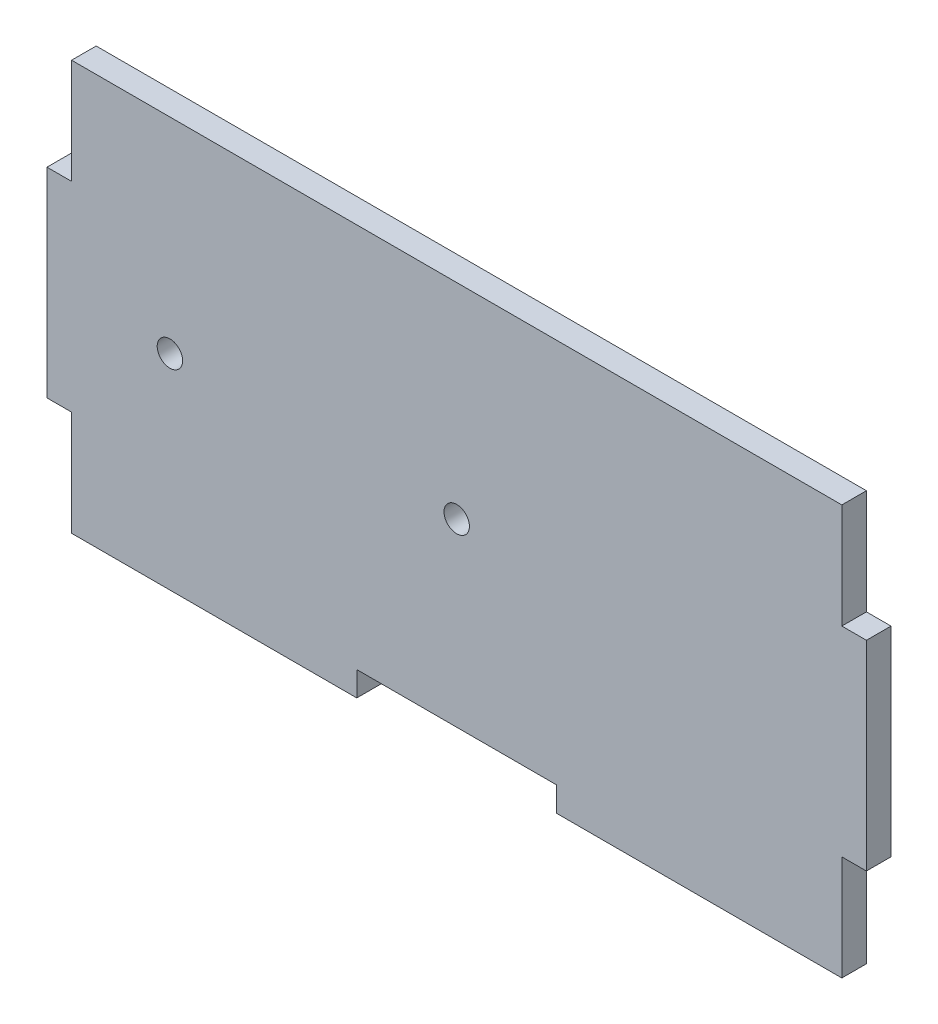
ISO-10303-21;
HEADER;
FILE_DESCRIPTION(('STEP AP214'),'2;1');
FILE_NAME('part.step','',(''),(''),'','','');
FILE_SCHEMA(('AUTOMOTIVE_DESIGN { 1 0 10303 214 1 1 1 1 }'));
ENDSEC;
DATA;
#1=APPLICATION_CONTEXT('core data for automotive mechanical design processes');
#2=APPLICATION_PROTOCOL_DEFINITION('international standard','automotive_design',2000,#1);
#3=PRODUCT_CONTEXT('',#1,'mechanical');
#4=PRODUCT('Part','Part','',(#3));
#5=PRODUCT_RELATED_PRODUCT_CATEGORY('part','',(#4));
#6=PRODUCT_DEFINITION_FORMATION('','',#4);
#7=PRODUCT_DEFINITION_CONTEXT('part definition',#1,'design');
#8=PRODUCT_DEFINITION('design','',#6,#7);
#9=PRODUCT_DEFINITION_SHAPE('','',#8);
#10=(LENGTH_UNIT() NAMED_UNIT(*) SI_UNIT(.MILLI.,.METRE.));
#11=(NAMED_UNIT(*) PLANE_ANGLE_UNIT() SI_UNIT($,.RADIAN.));
#12=(NAMED_UNIT(*) SI_UNIT($,.STERADIAN.) SOLID_ANGLE_UNIT());
#13=UNCERTAINTY_MEASURE_WITH_UNIT(LENGTH_MEASURE(1.E-05),#10,'distance_accuracy_value','');
#14=(GEOMETRIC_REPRESENTATION_CONTEXT(3) GLOBAL_UNCERTAINTY_ASSIGNED_CONTEXT((#13)) GLOBAL_UNIT_ASSIGNED_CONTEXT((#10,
#11,#12)) REPRESENTATION_CONTEXT('',''));
#15=CARTESIAN_POINT('',(0.,0.,0.));
#16=DIRECTION('',(0.,0.,1.));
#17=DIRECTION('',(1.,0.,0.));
#18=AXIS2_PLACEMENT_3D('',#15,#16,#17);
#19=CARTESIAN_POINT('',(280.,103.,3.));
#20=DIRECTION('',(0.,-1.,0.));
#21=DIRECTION('',(0.,0.,-1.));
#22=AXIS2_PLACEMENT_3D('',#19,#20,#21);
#23=PLANE('',#22);
#24=DIRECTION('',(-1.,0.,0.));
#25=VECTOR('',#24,1.);
#26=CARTESIAN_POINT('',(280.,103.,0.));
#27=LINE('',#26,#25);
#28=CARTESIAN_POINT('',(280.,103.,0.));
#29=VERTEX_POINT('',#28);
#30=CARTESIAN_POINT('',(186.,103.,0.));
#31=VERTEX_POINT('',#30);
#32=EDGE_CURVE('E176',#29,#31,#27,.T.);
#33=ORIENTED_EDGE('',*,*,#32,.T.);
#34=DIRECTION('',(0.,0.,-1.));
#35=VECTOR('',#34,1.);
#36=CARTESIAN_POINT('',(186.,103.,3.));
#37=LINE('',#36,#35);
#38=CARTESIAN_POINT('',(186.,103.,3.));
#39=VERTEX_POINT('',#38);
#40=EDGE_CURVE('E11',#39,#31,#37,.T.);
#41=ORIENTED_EDGE('',*,*,#40,.F.);
#42=DIRECTION('',(-1.,0.,0.));
#43=VECTOR('',#42,1.);
#44=CARTESIAN_POINT('',(280.,103.,3.));
#45=LINE('',#44,#43);
#46=CARTESIAN_POINT('',(280.,103.,3.));
#47=VERTEX_POINT('',#46);
#48=EDGE_CURVE('E208',#47,#39,#45,.T.);
#49=ORIENTED_EDGE('',*,*,#48,.F.);
#50=DIRECTION('',(0.,0.,-1.));
#51=VECTOR('',#50,1.);
#52=CARTESIAN_POINT('',(280.,103.,3.));
#53=LINE('',#52,#51);
#54=EDGE_CURVE('E172',#47,#29,#53,.T.);
#55=ORIENTED_EDGE('',*,*,#54,.T.);
#56=EDGE_LOOP('',(#33,#41,#49,#55));
#57=FACE_BOUND('',#56,.T.);
#58=ADVANCED_FACE('F32',(#57),#23,.F.);
#59=CARTESIAN_POINT('',(186.,103.,3.));
#60=DIRECTION('',(1.,0.,0.));
#61=DIRECTION('',(0.,0.,-1.));
#62=AXIS2_PLACEMENT_3D('',#59,#60,#61);
#63=PLANE('',#62);
#64=DIRECTION('',(0.,-1.,0.));
#65=VECTOR('',#64,1.);
#66=CARTESIAN_POINT('',(186.,103.,0.));
#67=LINE('',#66,#65);
#68=CARTESIAN_POINT('',(186.,90.195,0.));
#69=VERTEX_POINT('',#68);
#70=EDGE_CURVE('E179',#31,#69,#67,.T.);
#71=ORIENTED_EDGE('',*,*,#70,.T.);
#72=DIRECTION('',(0.,0.,-1.));
#73=VECTOR('',#72,1.);
#74=CARTESIAN_POINT('',(186.,90.195,3.));
#75=LINE('',#74,#73);
#76=CARTESIAN_POINT('',(186.,90.195,3.));
#77=VERTEX_POINT('',#76);
#78=EDGE_CURVE('E40',#77,#69,#75,.T.);
#79=ORIENTED_EDGE('',*,*,#78,.F.);
#80=DIRECTION('',(0.,-1.,0.));
#81=VECTOR('',#80,1.);
#82=CARTESIAN_POINT('',(186.,103.,3.));
#83=LINE('',#82,#81);
#84=EDGE_CURVE('E115',#39,#77,#83,.T.);
#85=ORIENTED_EDGE('',*,*,#84,.F.);
#86=ORIENTED_EDGE('',*,*,#40,.T.);
#87=EDGE_LOOP('',(#71,#79,#85,#86));
#88=FACE_BOUND('',#87,.T.);
#89=ADVANCED_FACE('F307',(#88),#63,.F.);
#90=CARTESIAN_POINT('',(186.,90.195,3.));
#91=DIRECTION('',(0.,-1.,0.));
#92=DIRECTION('',(0.,0.,-1.));
#93=AXIS2_PLACEMENT_3D('',#90,#91,#92);
#94=PLANE('',#93);
#95=DIRECTION('',(-1.,0.,0.));
#96=VECTOR('',#95,1.);
#97=CARTESIAN_POINT('',(186.,90.195,0.));
#98=LINE('',#97,#96);
#99=CARTESIAN_POINT('',(183.,90.195,0.));
#100=VERTEX_POINT('',#99);
#101=EDGE_CURVE('E182',#69,#100,#98,.T.);
#102=ORIENTED_EDGE('',*,*,#101,.T.);
#103=DIRECTION('',(0.,0.,-1.));
#104=VECTOR('',#103,1.);
#105=CARTESIAN_POINT('',(183.,90.195,3.));
#106=LINE('',#105,#104);
#107=CARTESIAN_POINT('',(183.,90.195,3.));
#108=VERTEX_POINT('',#107);
#109=EDGE_CURVE('E239',#108,#100,#106,.T.);
#110=ORIENTED_EDGE('',*,*,#109,.F.);
#111=DIRECTION('',(-1.,0.,0.));
#112=VECTOR('',#111,1.);
#113=CARTESIAN_POINT('',(186.,90.195,3.));
#114=LINE('',#113,#112);
#115=EDGE_CURVE('E247',#77,#108,#114,.T.);
#116=ORIENTED_EDGE('',*,*,#115,.F.);
#117=ORIENTED_EDGE('',*,*,#78,.T.);
#118=EDGE_LOOP('',(#102,#110,#116,#117));
#119=FACE_BOUND('',#118,.T.);
#120=ADVANCED_FACE('F245',(#119),#94,.F.);
#121=CARTESIAN_POINT('',(183.,90.195,3.));
#122=DIRECTION('',(1.,0.,0.));
#123=DIRECTION('',(0.,0.,-1.));
#124=AXIS2_PLACEMENT_3D('',#121,#122,#123);
#125=PLANE('',#124);
#126=DIRECTION('',(0.,-1.,0.));
#127=VECTOR('',#126,1.);
#128=CARTESIAN_POINT('',(183.,90.195,0.));
#129=LINE('',#128,#127);
#130=CARTESIAN_POINT('',(183.,65.805,0.));
#131=VERTEX_POINT('',#130);
#132=EDGE_CURVE('E184',#100,#131,#129,.T.);
#133=ORIENTED_EDGE('',*,*,#132,.T.);
#134=DIRECTION('',(0.,0.,-1.));
#135=VECTOR('',#134,1.);
#136=CARTESIAN_POINT('',(183.,65.805,3.));
#137=LINE('',#136,#135);
#138=CARTESIAN_POINT('',(183.,65.805,3.));
#139=VERTEX_POINT('',#138);
#140=EDGE_CURVE('E236',#139,#131,#137,.T.);
#141=ORIENTED_EDGE('',*,*,#140,.F.);
#142=DIRECTION('',(0.,-1.,0.));
#143=VECTOR('',#142,1.);
#144=CARTESIAN_POINT('',(183.,90.195,3.));
#145=LINE('',#144,#143);
#146=EDGE_CURVE('E265',#108,#139,#145,.T.);
#147=ORIENTED_EDGE('',*,*,#146,.F.);
#148=ORIENTED_EDGE('',*,*,#109,.T.);
#149=EDGE_LOOP('',(#133,#141,#147,#148));
#150=FACE_BOUND('',#149,.T.);
#151=ADVANCED_FACE('F256',(#150),#125,.F.);
#152=CARTESIAN_POINT('',(183.,65.805,3.));
#153=DIRECTION('',(0.,1.,0.));
#154=DIRECTION('',(0.,0.,1.));
#155=AXIS2_PLACEMENT_3D('',#152,#153,#154);
#156=PLANE('',#155);
#157=DIRECTION('',(1.,0.,0.));
#158=VECTOR('',#157,1.);
#159=CARTESIAN_POINT('',(183.,65.805,0.));
#160=LINE('',#159,#158);
#161=CARTESIAN_POINT('',(186.,65.805,0.));
#162=VERTEX_POINT('',#161);
#163=EDGE_CURVE('E186',#131,#162,#160,.T.);
#164=ORIENTED_EDGE('',*,*,#163,.T.);
#165=DIRECTION('',(0.,0.,-1.));
#166=VECTOR('',#165,1.);
#167=CARTESIAN_POINT('',(186.,65.805,3.));
#168=LINE('',#167,#166);
#169=CARTESIAN_POINT('',(186.,65.805,3.));
#170=VERTEX_POINT('',#169);
#171=EDGE_CURVE('E233',#170,#162,#168,.T.);
#172=ORIENTED_EDGE('',*,*,#171,.F.);
#173=DIRECTION('',(1.,0.,0.));
#174=VECTOR('',#173,1.);
#175=CARTESIAN_POINT('',(183.,65.805,3.));
#176=LINE('',#175,#174);
#177=EDGE_CURVE('E262',#139,#170,#176,.T.);
#178=ORIENTED_EDGE('',*,*,#177,.F.);
#179=ORIENTED_EDGE('',*,*,#140,.T.);
#180=EDGE_LOOP('',(#164,#172,#178,#179));
#181=FACE_BOUND('',#180,.T.);
#182=ADVANCED_FACE('F260',(#181),#156,.F.);
#183=CARTESIAN_POINT('',(186.,65.805,3.));
#184=DIRECTION('',(1.,0.,0.));
#185=DIRECTION('',(0.,0.,-1.));
#186=AXIS2_PLACEMENT_3D('',#183,#184,#185);
#187=PLANE('',#186);
#188=DIRECTION('',(0.,-1.,0.));
#189=VECTOR('',#188,1.);
#190=CARTESIAN_POINT('',(186.,65.805,0.));
#191=LINE('',#190,#189);
#192=CARTESIAN_POINT('',(186.,53.,0.));
#193=VERTEX_POINT('',#192);
#194=EDGE_CURVE('E188',#162,#193,#191,.T.);
#195=ORIENTED_EDGE('',*,*,#194,.T.);
#196=DIRECTION('',(0.,0.,-1.));
#197=VECTOR('',#196,1.);
#198=CARTESIAN_POINT('',(186.,53.,3.));
#199=LINE('',#198,#197);
#200=CARTESIAN_POINT('',(186.,53.,3.));
#201=VERTEX_POINT('',#200);
#202=EDGE_CURVE('E230',#201,#193,#199,.T.);
#203=ORIENTED_EDGE('',*,*,#202,.F.);
#204=DIRECTION('',(0.,-1.,0.));
#205=VECTOR('',#204,1.);
#206=CARTESIAN_POINT('',(186.,65.805,3.));
#207=LINE('',#206,#205);
#208=EDGE_CURVE('E264',#170,#201,#207,.T.);
#209=ORIENTED_EDGE('',*,*,#208,.F.);
#210=ORIENTED_EDGE('',*,*,#171,.T.);
#211=EDGE_LOOP('',(#195,#203,#209,#210));
#212=FACE_BOUND('',#211,.T.);
#213=ADVANCED_FACE('F320',(#212),#187,.F.);
#214=CARTESIAN_POINT('',(186.,53.,3.));
#215=DIRECTION('',(0.,1.,0.));
#216=DIRECTION('',(0.,0.,1.));
#217=AXIS2_PLACEMENT_3D('',#214,#215,#216);
#218=PLANE('',#217);
#219=DIRECTION('',(1.,0.,0.));
#220=VECTOR('',#219,1.);
#221=CARTESIAN_POINT('',(186.,53.,0.));
#222=LINE('',#221,#220);
#223=CARTESIAN_POINT('',(220.805,53.,0.));
#224=VERTEX_POINT('',#223);
#225=EDGE_CURVE('E190',#193,#224,#222,.T.);
#226=ORIENTED_EDGE('',*,*,#225,.T.);
#227=DIRECTION('',(0.,0.,-1.));
#228=VECTOR('',#227,1.);
#229=CARTESIAN_POINT('',(220.805,53.,3.));
#230=LINE('',#229,#228);
#231=CARTESIAN_POINT('',(220.805,53.,3.));
#232=VERTEX_POINT('',#231);
#233=EDGE_CURVE('E227',#232,#224,#230,.T.);
#234=ORIENTED_EDGE('',*,*,#233,.F.);
#235=DIRECTION('',(1.,0.,0.));
#236=VECTOR('',#235,1.);
#237=CARTESIAN_POINT('',(186.,53.,3.));
#238=LINE('',#237,#236);
#239=EDGE_CURVE('E267',#201,#232,#238,.T.);
#240=ORIENTED_EDGE('',*,*,#239,.F.);
#241=ORIENTED_EDGE('',*,*,#202,.T.);
#242=EDGE_LOOP('',(#226,#234,#240,#241));
#243=FACE_BOUND('',#242,.T.);
#244=ADVANCED_FACE('F323',(#243),#218,.F.);
#245=CARTESIAN_POINT('',(220.805,53.,3.));
#246=DIRECTION('',(-1.,0.,0.));
#247=DIRECTION('',(0.,0.,1.));
#248=AXIS2_PLACEMENT_3D('',#245,#246,#247);
#249=PLANE('',#248);
#250=DIRECTION('',(0.,1.,0.));
#251=VECTOR('',#250,1.);
#252=CARTESIAN_POINT('',(220.805,53.,0.));
#253=LINE('',#252,#251);
#254=CARTESIAN_POINT('',(220.805,56.,0.));
#255=VERTEX_POINT('',#254);
#256=EDGE_CURVE('E192',#224,#255,#253,.T.);
#257=ORIENTED_EDGE('',*,*,#256,.T.);
#258=DIRECTION('',(0.,0.,-1.));
#259=VECTOR('',#258,1.);
#260=CARTESIAN_POINT('',(220.805,56.,3.));
#261=LINE('',#260,#259);
#262=CARTESIAN_POINT('',(220.805,56.,3.));
#263=VERTEX_POINT('',#262);
#264=EDGE_CURVE('E224',#263,#255,#261,.T.);
#265=ORIENTED_EDGE('',*,*,#264,.F.);
#266=DIRECTION('',(0.,1.,0.));
#267=VECTOR('',#266,1.);
#268=CARTESIAN_POINT('',(220.805,53.,3.));
#269=LINE('',#268,#267);
#270=EDGE_CURVE('E273',#232,#263,#269,.T.);
#271=ORIENTED_EDGE('',*,*,#270,.F.);
#272=ORIENTED_EDGE('',*,*,#233,.T.);
#273=EDGE_LOOP('',(#257,#265,#271,#272));
#274=FACE_BOUND('',#273,.T.);
#275=ADVANCED_FACE('F327',(#274),#249,.F.);
#276=CARTESIAN_POINT('',(220.805,56.,3.));
#277=DIRECTION('',(0.,1.,0.));
#278=DIRECTION('',(0.,0.,1.));
#279=AXIS2_PLACEMENT_3D('',#276,#277,#278);
#280=PLANE('',#279);
#281=DIRECTION('',(1.,0.,0.));
#282=VECTOR('',#281,1.);
#283=CARTESIAN_POINT('',(220.805,56.,0.));
#284=LINE('',#283,#282);
#285=CARTESIAN_POINT('',(245.195,56.,0.));
#286=VERTEX_POINT('',#285);
#287=EDGE_CURVE('E194',#255,#286,#284,.T.);
#288=ORIENTED_EDGE('',*,*,#287,.T.);
#289=DIRECTION('',(0.,0.,-1.));
#290=VECTOR('',#289,1.);
#291=CARTESIAN_POINT('',(245.195,56.,3.));
#292=LINE('',#291,#290);
#293=CARTESIAN_POINT('',(245.195,56.,3.));
#294=VERTEX_POINT('',#293);
#295=EDGE_CURVE('E221',#294,#286,#292,.T.);
#296=ORIENTED_EDGE('',*,*,#295,.F.);
#297=DIRECTION('',(1.,0.,0.));
#298=VECTOR('',#297,1.);
#299=CARTESIAN_POINT('',(220.805,56.,3.));
#300=LINE('',#299,#298);
#301=EDGE_CURVE('E275',#263,#294,#300,.T.);
#302=ORIENTED_EDGE('',*,*,#301,.F.);
#303=ORIENTED_EDGE('',*,*,#264,.T.);
#304=EDGE_LOOP('',(#288,#296,#302,#303));
#305=FACE_BOUND('',#304,.T.);
#306=ADVANCED_FACE('F331',(#305),#280,.F.);
#307=CARTESIAN_POINT('',(245.195,56.,3.));
#308=DIRECTION('',(1.,0.,0.));
#309=DIRECTION('',(0.,0.,-1.));
#310=AXIS2_PLACEMENT_3D('',#307,#308,#309);
#311=PLANE('',#310);
#312=DIRECTION('',(0.,-1.,0.));
#313=VECTOR('',#312,1.);
#314=CARTESIAN_POINT('',(245.195,56.,0.));
#315=LINE('',#314,#313);
#316=CARTESIAN_POINT('',(245.195,53.,0.));
#317=VERTEX_POINT('',#316);
#318=EDGE_CURVE('E196',#286,#317,#315,.T.);
#319=ORIENTED_EDGE('',*,*,#318,.T.);
#320=DIRECTION('',(0.,0.,-1.));
#321=VECTOR('',#320,1.);
#322=CARTESIAN_POINT('',(245.195,53.,3.));
#323=LINE('',#322,#321);
#324=CARTESIAN_POINT('',(245.195,53.,3.));
#325=VERTEX_POINT('',#324);
#326=EDGE_CURVE('E218',#325,#317,#323,.T.);
#327=ORIENTED_EDGE('',*,*,#326,.F.);
#328=DIRECTION('',(0.,-1.,0.));
#329=VECTOR('',#328,1.);
#330=CARTESIAN_POINT('',(245.195,56.,3.));
#331=LINE('',#330,#329);
#332=EDGE_CURVE('E277',#294,#325,#331,.T.);
#333=ORIENTED_EDGE('',*,*,#332,.F.);
#334=ORIENTED_EDGE('',*,*,#295,.T.);
#335=EDGE_LOOP('',(#319,#327,#333,#334));
#336=FACE_BOUND('',#335,.T.);
#337=ADVANCED_FACE('F335',(#336),#311,.F.);
#338=CARTESIAN_POINT('',(269.585,53.,3.));
#339=DIRECTION('',(0.,1.,0.));
#340=DIRECTION('',(0.,0.,1.));
#341=AXIS2_PLACEMENT_3D('',#338,#339,#340);
#342=PLANE('',#341);
#343=DIRECTION('',(1.,0.,0.));
#344=VECTOR('',#343,1.);
#345=CARTESIAN_POINT('',(269.585,53.,0.));
#346=LINE('',#345,#344);
#347=CARTESIAN_POINT('',(280.,53.,0.));
#348=VERTEX_POINT('',#347);
#349=EDGE_CURVE('E199',#317,#348,#346,.T.);
#350=ORIENTED_EDGE('',*,*,#349,.T.);
#351=DIRECTION('',(0.,0.,-1.));
#352=VECTOR('',#351,1.);
#353=CARTESIAN_POINT('',(280.,53.,3.));
#354=LINE('',#353,#352);
#355=CARTESIAN_POINT('',(280.,53.,3.));
#356=VERTEX_POINT('',#355);
#357=EDGE_CURVE('E215',#356,#348,#354,.T.);
#358=ORIENTED_EDGE('',*,*,#357,.F.);
#359=DIRECTION('',(1.,0.,0.));
#360=VECTOR('',#359,1.);
#361=CARTESIAN_POINT('',(245.195,53.,3.));
#362=LINE('',#361,#360);
#363=EDGE_CURVE('E279',#325,#356,#362,.T.);
#364=ORIENTED_EDGE('',*,*,#363,.F.);
#365=ORIENTED_EDGE('',*,*,#326,.T.);
#366=EDGE_LOOP('',(#350,#358,#364,#365));
#367=FACE_BOUND('',#366,.T.);
#368=ADVANCED_FACE('F339',(#367),#342,.F.);
#369=CARTESIAN_POINT('',(280.,53.,3.));
#370=DIRECTION('',(-1.,0.,0.));
#371=DIRECTION('',(0.,0.,1.));
#372=AXIS2_PLACEMENT_3D('',#369,#370,#371);
#373=PLANE('',#372);
#374=DIRECTION('',(0.,1.,0.));
#375=VECTOR('',#374,1.);
#376=CARTESIAN_POINT('',(280.,53.,0.));
#377=LINE('',#376,#375);
#378=CARTESIAN_POINT('',(280.,65.805,0.));
#379=VERTEX_POINT('',#378);
#380=EDGE_CURVE('E201',#348,#379,#377,.T.);
#381=ORIENTED_EDGE('',*,*,#380,.T.);
#382=DIRECTION('',(0.,0.,-1.));
#383=VECTOR('',#382,1.);
#384=CARTESIAN_POINT('',(280.,65.805,3.));
#385=LINE('',#384,#383);
#386=CARTESIAN_POINT('',(280.,65.805,3.));
#387=VERTEX_POINT('',#386);
#388=EDGE_CURVE('E212',#387,#379,#385,.T.);
#389=ORIENTED_EDGE('',*,*,#388,.F.);
#390=DIRECTION('',(0.,1.,0.));
#391=VECTOR('',#390,1.);
#392=CARTESIAN_POINT('',(280.,53.,3.));
#393=LINE('',#392,#391);
#394=EDGE_CURVE('E281',#356,#387,#393,.T.);
#395=ORIENTED_EDGE('',*,*,#394,.F.);
#396=ORIENTED_EDGE('',*,*,#357,.T.);
#397=EDGE_LOOP('',(#381,#389,#395,#396));
#398=FACE_BOUND('',#397,.T.);
#399=ADVANCED_FACE('F287',(#398),#373,.F.);
#400=CARTESIAN_POINT('',(280.,65.805,3.));
#401=DIRECTION('',(0.,1.,0.));
#402=DIRECTION('',(0.,0.,1.));
#403=AXIS2_PLACEMENT_3D('',#400,#401,#402);
#404=PLANE('',#403);
#405=DIRECTION('',(1.,0.,0.));
#406=VECTOR('',#405,1.);
#407=CARTESIAN_POINT('',(280.,65.805,0.));
#408=LINE('',#407,#406);
#409=CARTESIAN_POINT('',(283.,65.805,0.));
#410=VERTEX_POINT('',#409);
#411=EDGE_CURVE('E203',#379,#410,#408,.T.);
#412=ORIENTED_EDGE('',*,*,#411,.T.);
#413=DIRECTION('',(0.,0.,-1.));
#414=VECTOR('',#413,1.);
#415=CARTESIAN_POINT('',(283.,65.805,3.));
#416=LINE('',#415,#414);
#417=CARTESIAN_POINT('',(283.,65.805,3.));
#418=VERTEX_POINT('',#417);
#419=EDGE_CURVE('E167',#418,#410,#416,.T.);
#420=ORIENTED_EDGE('',*,*,#419,.F.);
#421=DIRECTION('',(1.,0.,0.));
#422=VECTOR('',#421,1.);
#423=CARTESIAN_POINT('',(280.,65.805,3.));
#424=LINE('',#423,#422);
#425=EDGE_CURVE('E158',#387,#418,#424,.T.);
#426=ORIENTED_EDGE('',*,*,#425,.F.);
#427=ORIENTED_EDGE('',*,*,#388,.T.);
#428=EDGE_LOOP('',(#412,#420,#426,#427));
#429=FACE_BOUND('',#428,.T.);
#430=ADVANCED_FACE('F291',(#429),#404,.F.);
#431=CARTESIAN_POINT('',(283.,65.805,3.));
#432=DIRECTION('',(-1.,0.,0.));
#433=DIRECTION('',(0.,0.,1.));
#434=AXIS2_PLACEMENT_3D('',#431,#432,#433);
#435=PLANE('',#434);
#436=DIRECTION('',(0.,1.,0.));
#437=VECTOR('',#436,1.);
#438=CARTESIAN_POINT('',(283.,65.805,0.));
#439=LINE('',#438,#437);
#440=CARTESIAN_POINT('',(283.,90.195,0.));
#441=VERTEX_POINT('',#440);
#442=EDGE_CURVE('E166',#410,#441,#439,.T.);
#443=ORIENTED_EDGE('',*,*,#442,.T.);
#444=DIRECTION('',(0.,0.,-1.));
#445=VECTOR('',#444,1.);
#446=CARTESIAN_POINT('',(283.,90.195,3.));
#447=LINE('',#446,#445);
#448=CARTESIAN_POINT('',(283.,90.195,3.));
#449=VERTEX_POINT('',#448);
#450=EDGE_CURVE('E163',#449,#441,#447,.T.);
#451=ORIENTED_EDGE('',*,*,#450,.F.);
#452=DIRECTION('',(0.,1.,0.));
#453=VECTOR('',#452,1.);
#454=CARTESIAN_POINT('',(283.,65.805,3.));
#455=LINE('',#454,#453);
#456=EDGE_CURVE('E152',#418,#449,#455,.T.);
#457=ORIENTED_EDGE('',*,*,#456,.F.);
#458=ORIENTED_EDGE('',*,*,#419,.T.);
#459=EDGE_LOOP('',(#443,#451,#457,#458));
#460=FACE_BOUND('',#459,.T.);
#461=ADVANCED_FACE('F164',(#460),#435,.F.);
#462=CARTESIAN_POINT('',(283.,90.195,3.));
#463=DIRECTION('',(0.,-1.,0.));
#464=DIRECTION('',(0.,0.,-1.));
#465=AXIS2_PLACEMENT_3D('',#462,#463,#464);
#466=PLANE('',#465);
#467=DIRECTION('',(-1.,0.,0.));
#468=VECTOR('',#467,1.);
#469=CARTESIAN_POINT('',(283.,90.195,0.));
#470=LINE('',#469,#468);
#471=CARTESIAN_POINT('',(280.,90.195,0.));
#472=VERTEX_POINT('',#471);
#473=EDGE_CURVE('E101',#441,#472,#470,.T.);
#474=ORIENTED_EDGE('',*,*,#473,.T.);
#475=DIRECTION('',(0.,0.,-1.));
#476=VECTOR('',#475,1.);
#477=CARTESIAN_POINT('',(280.,90.195,3.));
#478=LINE('',#477,#476);
#479=CARTESIAN_POINT('',(280.,90.195,3.));
#480=VERTEX_POINT('',#479);
#481=EDGE_CURVE('E168',#480,#472,#478,.T.);
#482=ORIENTED_EDGE('',*,*,#481,.F.);
#483=DIRECTION('',(-1.,0.,0.));
#484=VECTOR('',#483,1.);
#485=CARTESIAN_POINT('',(283.,90.195,3.));
#486=LINE('',#485,#484);
#487=EDGE_CURVE('E156',#449,#480,#486,.T.);
#488=ORIENTED_EDGE('',*,*,#487,.F.);
#489=ORIENTED_EDGE('',*,*,#450,.T.);
#490=EDGE_LOOP('',(#474,#482,#488,#489));
#491=FACE_BOUND('',#490,.T.);
#492=ADVANCED_FACE('F170',(#491),#466,.F.);
#493=CARTESIAN_POINT('',(280.,90.195,3.));
#494=DIRECTION('',(-1.,0.,0.));
#495=DIRECTION('',(0.,0.,1.));
#496=AXIS2_PLACEMENT_3D('',#493,#494,#495);
#497=PLANE('',#496);
#498=DIRECTION('',(0.,1.,0.));
#499=VECTOR('',#498,1.);
#500=CARTESIAN_POINT('',(280.,90.195,0.));
#501=LINE('',#500,#499);
#502=EDGE_CURVE('E107',#472,#29,#501,.T.);
#503=ORIENTED_EDGE('',*,*,#502,.T.);
#504=ORIENTED_EDGE('',*,*,#54,.F.);
#505=DIRECTION('',(0.,1.,0.));
#506=VECTOR('',#505,1.);
#507=CARTESIAN_POINT('',(280.,90.195,3.));
#508=LINE('',#507,#506);
#509=EDGE_CURVE('E48',#480,#47,#508,.T.);
#510=ORIENTED_EDGE('',*,*,#509,.F.);
#511=ORIENTED_EDGE('',*,*,#481,.T.);
#512=EDGE_LOOP('',(#503,#504,#510,#511));
#513=FACE_BOUND('',#512,.T.);
#514=ADVANCED_FACE('F295',(#513),#497,.F.);
#515=CARTESIAN_POINT('',(0.,0.,3.));
#516=DIRECTION('',(0.,0.,1.));
#517=DIRECTION('',(1.,0.,0.));
#518=AXIS2_PLACEMENT_3D('',#515,#516,#517);
#519=PLANE('',#518);
#520=CARTESIAN_POINT('',(233.,78.,3.));
#521=DIRECTION('',(0.,0.,1.));
#522=DIRECTION('',(1.,0.,0.));
#523=AXIS2_PLACEMENT_3D('',#520,#521,#522);
#524=CIRCLE('',#523,1.54999999999999);
#525=CARTESIAN_POINT('',(234.55,78.,3.));
#526=VERTEX_POINT('',#525);
#527=EDGE_CURVE('E404',#526,#526,#524,.T.);
#528=ORIENTED_EDGE('',*,*,#527,.F.);
#529=EDGE_LOOP('',(#528));
#530=FACE_BOUND('',#529,.T.);
#531=CARTESIAN_POINT('',(198.,78.,3.));
#532=DIRECTION('',(0.,0.,1.));
#533=DIRECTION('',(1.,0.,0.));
#534=AXIS2_PLACEMENT_3D('',#531,#532,#533);
#535=CIRCLE('',#534,1.54999999999999);
#536=CARTESIAN_POINT('',(199.55,78.,3.));
#537=VERTEX_POINT('',#536);
#538=EDGE_CURVE('E409',#537,#537,#535,.T.);
#539=ORIENTED_EDGE('',*,*,#538,.F.);
#540=EDGE_LOOP('',(#539));
#541=FACE_BOUND('',#540,.T.);
#542=ORIENTED_EDGE('',*,*,#48,.T.);
#543=ORIENTED_EDGE('',*,*,#84,.T.);
#544=ORIENTED_EDGE('',*,*,#115,.T.);
#545=ORIENTED_EDGE('',*,*,#146,.T.);
#546=ORIENTED_EDGE('',*,*,#177,.T.);
#547=ORIENTED_EDGE('',*,*,#208,.T.);
#548=ORIENTED_EDGE('',*,*,#239,.T.);
#549=ORIENTED_EDGE('',*,*,#270,.T.);
#550=ORIENTED_EDGE('',*,*,#301,.T.);
#551=ORIENTED_EDGE('',*,*,#332,.T.);
#552=ORIENTED_EDGE('',*,*,#363,.T.);
#553=ORIENTED_EDGE('',*,*,#394,.T.);
#554=ORIENTED_EDGE('',*,*,#425,.T.);
#555=ORIENTED_EDGE('',*,*,#456,.T.);
#556=ORIENTED_EDGE('',*,*,#487,.T.);
#557=ORIENTED_EDGE('',*,*,#509,.T.);
#558=EDGE_LOOP('',(#542,#543,#544,#545,#546,#547,#548,#549,#550,#551,#552,#553,#554,#555,#556,#557));
#559=FACE_BOUND('',#558,.T.);
#560=ADVANCED_FACE('F154',(#530,#541,#559),#519,.T.);
#561=CARTESIAN_POINT('',(0.,0.,0.));
#562=DIRECTION('',(0.,0.,1.));
#563=DIRECTION('',(1.,0.,0.));
#564=AXIS2_PLACEMENT_3D('',#561,#562,#563);
#565=PLANE('',#564);
#566=CARTESIAN_POINT('',(233.,78.,0.));
#567=DIRECTION('',(0.,0.,1.));
#568=DIRECTION('',(1.,0.,0.));
#569=AXIS2_PLACEMENT_3D('',#566,#567,#568);
#570=CIRCLE('',#569,1.54999999999999);
#571=CARTESIAN_POINT('',(234.55,78.,0.));
#572=VERTEX_POINT('',#571);
#573=EDGE_CURVE('E180',#572,#572,#570,.T.);
#574=ORIENTED_EDGE('',*,*,#573,.T.);
#575=EDGE_LOOP('',(#574));
#576=FACE_BOUND('',#575,.T.);
#577=CARTESIAN_POINT('',(198.,78.,0.));
#578=DIRECTION('',(0.,0.,1.));
#579=DIRECTION('',(1.,0.,0.));
#580=AXIS2_PLACEMENT_3D('',#577,#578,#579);
#581=CIRCLE('',#580,1.54999999999999);
#582=CARTESIAN_POINT('',(199.55,78.,0.));
#583=VERTEX_POINT('',#582);
#584=EDGE_CURVE('E405',#583,#583,#581,.T.);
#585=ORIENTED_EDGE('',*,*,#584,.T.);
#586=EDGE_LOOP('',(#585));
#587=FACE_BOUND('',#586,.T.);
#588=ORIENTED_EDGE('',*,*,#32,.F.);
#589=ORIENTED_EDGE('',*,*,#502,.F.);
#590=ORIENTED_EDGE('',*,*,#473,.F.);
#591=ORIENTED_EDGE('',*,*,#442,.F.);
#592=ORIENTED_EDGE('',*,*,#411,.F.);
#593=ORIENTED_EDGE('',*,*,#380,.F.);
#594=ORIENTED_EDGE('',*,*,#349,.F.);
#595=ORIENTED_EDGE('',*,*,#318,.F.);
#596=ORIENTED_EDGE('',*,*,#287,.F.);
#597=ORIENTED_EDGE('',*,*,#256,.F.);
#598=ORIENTED_EDGE('',*,*,#225,.F.);
#599=ORIENTED_EDGE('',*,*,#194,.F.);
#600=ORIENTED_EDGE('',*,*,#163,.F.);
#601=ORIENTED_EDGE('',*,*,#132,.F.);
#602=ORIENTED_EDGE('',*,*,#101,.F.);
#603=ORIENTED_EDGE('',*,*,#70,.F.);
#604=EDGE_LOOP('',(#588,#589,#590,#591,#592,#593,#594,#595,#596,#597,#598,#599,#600,#601,#602,#603));
#605=FACE_BOUND('',#604,.T.);
#606=ADVANCED_FACE('F251',(#576,#587,#605),#565,.F.);
#607=CARTESIAN_POINT('',(198.,78.,0.));
#608=DIRECTION('',(0.,0.,1.));
#609=DIRECTION('',(1.,0.,0.));
#610=AXIS2_PLACEMENT_3D('',#607,#608,#609);
#611=CYLINDRICAL_SURFACE('',#610,1.54999999999999);
#612=ORIENTED_EDGE('',*,*,#584,.F.);
#613=EDGE_LOOP('',(#612));
#614=FACE_BOUND('',#613,.T.);
#615=ORIENTED_EDGE('',*,*,#538,.T.);
#616=EDGE_LOOP('',(#615));
#617=FACE_BOUND('',#616,.T.);
#618=ADVANCED_FACE('F376',(#614,#617),#611,.F.);
#619=CARTESIAN_POINT('',(233.,78.,0.));
#620=DIRECTION('',(0.,0.,1.));
#621=DIRECTION('',(1.,0.,0.));
#622=AXIS2_PLACEMENT_3D('',#619,#620,#621);
#623=CYLINDRICAL_SURFACE('',#622,1.54999999999999);
#624=ORIENTED_EDGE('',*,*,#573,.F.);
#625=EDGE_LOOP('',(#624));
#626=FACE_BOUND('',#625,.T.);
#627=ORIENTED_EDGE('',*,*,#527,.T.);
#628=EDGE_LOOP('',(#627));
#629=FACE_BOUND('',#628,.T.);
#630=ADVANCED_FACE('F385',(#626,#629),#623,.F.);
#631=CLOSED_SHELL('',(#58,#89,#120,#151,#182,#213,#244,#275,#306,#337,#368,#399,#430,#461,#492,
#514,#560,#606,#618,#630));
#632=MANIFOLD_SOLID_BREP('B2',#631);
#633=ADVANCED_BREP_SHAPE_REPRESENTATION('',(#18,#632),#14);
#634=SHAPE_DEFINITION_REPRESENTATION(#9,#633);
ENDSEC;
END-ISO-10303-21;
